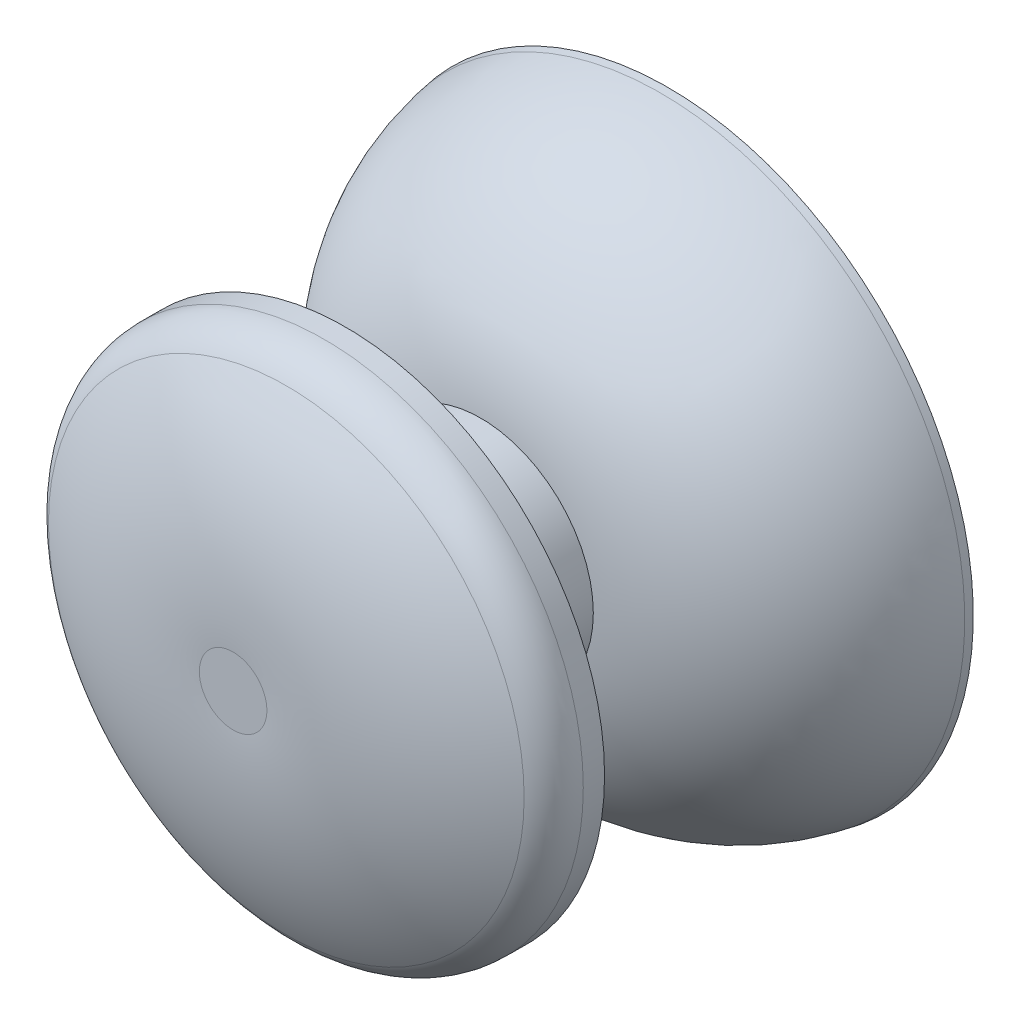
ISO-10303-21;
HEADER;
FILE_DESCRIPTION(('STEP AP214'),'2;1');
FILE_NAME('part.step','',(''),(''),'','','');
FILE_SCHEMA(('AUTOMOTIVE_DESIGN { 1 0 10303 214 1 1 1 1 }'));
ENDSEC;
DATA;
#1=APPLICATION_CONTEXT('core data for automotive mechanical design processes');
#2=APPLICATION_PROTOCOL_DEFINITION('international standard','automotive_design',2000,#1);
#3=PRODUCT_CONTEXT('',#1,'mechanical');
#4=PRODUCT('Part','Part','',(#3));
#5=PRODUCT_RELATED_PRODUCT_CATEGORY('part','',(#4));
#6=PRODUCT_DEFINITION_FORMATION('','',#4);
#7=PRODUCT_DEFINITION_CONTEXT('part definition',#1,'design');
#8=PRODUCT_DEFINITION('design','',#6,#7);
#9=PRODUCT_DEFINITION_SHAPE('','',#8);
#10=(LENGTH_UNIT() NAMED_UNIT(*) SI_UNIT(.MILLI.,.METRE.));
#11=(NAMED_UNIT(*) PLANE_ANGLE_UNIT() SI_UNIT($,.RADIAN.));
#12=(NAMED_UNIT(*) SI_UNIT($,.STERADIAN.) SOLID_ANGLE_UNIT());
#13=UNCERTAINTY_MEASURE_WITH_UNIT(LENGTH_MEASURE(1.E-05),#10,'distance_accuracy_value','');
#14=(GEOMETRIC_REPRESENTATION_CONTEXT(3) GLOBAL_UNCERTAINTY_ASSIGNED_CONTEXT((#13)) GLOBAL_UNIT_ASSIGNED_CONTEXT((#10,
#11,#12)) REPRESENTATION_CONTEXT('',''));
#15=CARTESIAN_POINT('',(0.,0.,0.));
#16=DIRECTION('',(0.,0.,1.));
#17=DIRECTION('',(1.,0.,0.));
#18=AXIS2_PLACEMENT_3D('',#15,#16,#17);
#19=CARTESIAN_POINT('',(55.2886051822846,12.3610868283743,18.2552883496559));
#20=DIRECTION('',(0.,0.,-1.));
#21=DIRECTION('',(-1.,0.,0.));
#22=AXIS2_PLACEMENT_3D('',#19,#20,#21);
#23=DEGENERATE_TOROIDAL_SURFACE('',#22,2.30270713318515,15.5154899332562,.T.);
#24=CARTESIAN_POINT('',(55.2886051822846,12.3610868283743,33.75));
#25=DIRECTION('',(0.,0.,-1.));
#26=DIRECTION('',(-1.,0.,0.));
#27=AXIS2_PLACEMENT_3D('',#24,#25,#26);
#28=CIRCLE('',#27,1.49999999999958);
#29=CARTESIAN_POINT('',(53.788605182285,12.3610868283743,33.75));
#30=VERTEX_POINT('',#29);
#31=EDGE_CURVE('E10',#30,#30,#28,.T.);
#32=ORIENTED_EDGE('',*,*,#31,.T.);
#33=EDGE_LOOP('',(#32));
#34=FACE_BOUND('',#33,.T.);
#35=CARTESIAN_POINT('',(55.2886051822846,12.3610868283743,31.3878518606448));
#36=DIRECTION('',(0.,0.,-1.));
#37=DIRECTION('',(-1.,0.,0.));
#38=AXIS2_PLACEMENT_3D('',#35,#36,#37);
#39=CIRCLE('',#38,10.5650435762754);
#40=CARTESIAN_POINT('',(44.7235616060092,12.3610868283743,31.3878518606448));
#41=VERTEX_POINT('',#40);
#42=EDGE_CURVE('E73',#41,#41,#39,.T.);
#43=ORIENTED_EDGE('',*,*,#42,.F.);
#44=EDGE_LOOP('',(#43));
#45=FACE_BOUND('',#44,.T.);
#46=ADVANCED_FACE('F30',(#34,#45),#23,.T.);
#47=CARTESIAN_POINT('',(56.7886051822842,12.3610868283743,33.75));
#48=DIRECTION('',(0.,0.,1.));
#49=DIRECTION('',(1.,0.,0.));
#50=AXIS2_PLACEMENT_3D('',#47,#48,#49);
#51=PLANE('',#50);
#52=ORIENTED_EDGE('',*,*,#31,.F.);
#53=EDGE_LOOP('',(#52));
#54=FACE_BOUND('',#53,.T.);
#55=ADVANCED_FACE('F81',(#54),#51,.T.);
#56=CARTESIAN_POINT('',(55.2886051822846,12.3610868283743,24.5842158486551));
#57=DIRECTION('',(0.,0.,-1.));
#58=DIRECTION('',(-1.,0.,0.));
#59=AXIS2_PLACEMENT_3D('',#56,#57,#58);
#60=PLANE('',#59);
#61=CARTESIAN_POINT('',(55.2886051822846,12.3610868283743,24.5842158486551));
#62=DIRECTION('',(0.,0.,-1.));
#63=DIRECTION('',(-1.,0.,0.));
#64=AXIS2_PLACEMENT_3D('',#61,#62,#63);
#65=CIRCLE('',#64,1.61377989283939);
#66=CARTESIAN_POINT('',(53.6748252894452,12.3610868283743,24.5842158486551));
#67=VERTEX_POINT('',#66);
#68=EDGE_CURVE('E36',#67,#67,#65,.T.);
#69=ORIENTED_EDGE('',*,*,#68,.T.);
#70=EDGE_LOOP('',(#69));
#71=FACE_BOUND('',#70,.T.);
#72=ADVANCED_FACE('F85',(#71),#60,.T.);
#73=CARTESIAN_POINT('',(55.2886051822846,12.3610868283743,33.7707782829122));
#74=DIRECTION('',(0.,0.,-1.));
#75=DIRECTION('',(-1.,0.,0.));
#76=AXIS2_PLACEMENT_3D('',#73,#74,#75);
#77=CYLINDRICAL_SURFACE('',#76,1.61377989283939);
#78=CARTESIAN_POINT('',(55.2886051822846,12.3610868283743,19.6671079243275));
#79=DIRECTION('',(0.,0.,-1.));
#80=DIRECTION('',(-1.,0.,0.));
#81=AXIS2_PLACEMENT_3D('',#78,#79,#80);
#82=CIRCLE('',#81,1.61377989283939);
#83=CARTESIAN_POINT('',(53.6748252894452,12.3610868283743,19.6671079243275));
#84=VERTEX_POINT('',#83);
#85=EDGE_CURVE('E40',#84,#84,#82,.T.);
#86=ORIENTED_EDGE('',*,*,#85,.T.);
#87=EDGE_LOOP('',(#86));
#88=FACE_BOUND('',#87,.T.);
#89=ORIENTED_EDGE('',*,*,#68,.F.);
#90=EDGE_LOOP('',(#89));
#91=FACE_BOUND('',#90,.T.);
#92=ADVANCED_FACE('F90',(#88,#91),#77,.F.);
#93=CARTESIAN_POINT('',(56.902385075124,12.3610868283743,19.6671079243275));
#94=DIRECTION('',(0.,0.,-1.));
#95=DIRECTION('',(-1.,0.,0.));
#96=AXIS2_PLACEMENT_3D('',#93,#94,#95);
#97=PLANE('',#96);
#98=CARTESIAN_POINT('',(55.2886051822846,12.3610868283743,19.6671079243275));
#99=DIRECTION('',(0.,0.,-1.));
#100=DIRECTION('',(-1.,0.,0.));
#101=AXIS2_PLACEMENT_3D('',#98,#99,#100);
#102=CIRCLE('',#101,8.82212376583157);
#103=CARTESIAN_POINT('',(46.466481416453,12.3610868283743,19.6671079243275));
#104=VERTEX_POINT('',#103);
#105=EDGE_CURVE('E44',#104,#104,#102,.T.);
#106=ORIENTED_EDGE('',*,*,#105,.T.);
#107=EDGE_LOOP('',(#106));
#108=FACE_BOUND('',#107,.T.);
#109=ORIENTED_EDGE('',*,*,#85,.F.);
#110=EDGE_LOOP('',(#109));
#111=FACE_BOUND('',#110,.T.);
#112=ADVANCED_FACE('F95',(#108,#111),#97,.T.);
#113=CARTESIAN_POINT('',(55.2886051822846,12.3610868283743,13.0193991709851));
#114=DIRECTION('',(0.,0.,-1.));
#115=DIRECTION('',(-1.,0.,0.));
#116=AXIS2_PLACEMENT_3D('',#113,#114,#115);
#117=DEGENERATE_TOROIDAL_SURFACE('',#116,3.85649333739738,8.29756091999675,.T.);
#118=CARTESIAN_POINT('',(55.2886051822846,12.3610868283743,14.75));
#119=DIRECTION('',(0.,0.,-1.));
#120=DIRECTION('',(-1.,0.,0.));
#121=AXIS2_PLACEMENT_3D('',#118,#119,#120);
#122=CIRCLE('',#121,11.9715742360496);
#123=CARTESIAN_POINT('',(43.317030946235,12.3610868283743,14.75));
#124=VERTEX_POINT('',#123);
#125=EDGE_CURVE('E49',#124,#124,#122,.T.);
#126=ORIENTED_EDGE('',*,*,#125,.T.);
#127=EDGE_LOOP('',(#126));
#128=FACE_BOUND('',#127,.T.);
#129=ORIENTED_EDGE('',*,*,#105,.F.);
#130=EDGE_LOOP('',(#129));
#131=FACE_BOUND('',#130,.T.);
#132=ADVANCED_FACE('F99',(#128,#131),#117,.F.);
#133=CARTESIAN_POINT('',(55.2886051822846,12.3610868283743,14.75));
#134=DIRECTION('',(0.,0.,-1.));
#135=DIRECTION('',(-1.,0.,0.));
#136=AXIS2_PLACEMENT_3D('',#133,#134,#135);
#137=CONICAL_SURFACE('',#136,11.9715742360496,0.210109931154276);
#138=CARTESIAN_POINT('',(55.2886051822846,12.3610868283743,14.42433044389));
#139=DIRECTION('',(0.,0.,-1.));
#140=DIRECTION('',(-1.,0.,0.));
#141=AXIS2_PLACEMENT_3D('',#138,#139,#140);
#142=CIRCLE('',#141,12.0410256698465);
#143=CARTESIAN_POINT('',(43.2475795124381,12.3610868283743,14.42433044389));
#144=VERTEX_POINT('',#143);
#145=EDGE_CURVE('E52',#144,#144,#142,.T.);
#146=ORIENTED_EDGE('',*,*,#145,.T.);
#147=EDGE_LOOP('',(#146));
#148=FACE_BOUND('',#147,.T.);
#149=ORIENTED_EDGE('',*,*,#125,.F.);
#150=EDGE_LOOP('',(#149));
#151=FACE_BOUND('',#150,.T.);
#152=ADVANCED_FACE('F103',(#148,#151),#137,.F.);
#153=CARTESIAN_POINT('',(67.3296308521311,12.3610868283743,14.42433044389));
#154=DIRECTION('',(0.,0.,-1.));
#155=DIRECTION('',(-1.,0.,0.));
#156=AXIS2_PLACEMENT_3D('',#153,#154,#155);
#157=PLANE('',#156);
#158=CARTESIAN_POINT('',(55.2886051822846,12.3610868283743,14.42433044389));
#159=DIRECTION('',(0.,0.,-1.));
#160=DIRECTION('',(-1.,0.,0.));
#161=AXIS2_PLACEMENT_3D('',#158,#159,#160);
#162=CIRCLE('',#161,13.5537477082164);
#163=CARTESIAN_POINT('',(41.7348574740682,12.3610868283743,14.42433044389));
#164=VERTEX_POINT('',#163);
#165=EDGE_CURVE('E55',#164,#164,#162,.T.);
#166=ORIENTED_EDGE('',*,*,#165,.T.);
#167=EDGE_LOOP('',(#166));
#168=FACE_BOUND('',#167,.T.);
#169=ORIENTED_EDGE('',*,*,#145,.F.);
#170=EDGE_LOOP('',(#169));
#171=FACE_BOUND('',#170,.T.);
#172=ADVANCED_FACE('F107',(#168,#171),#157,.T.);
#173=CARTESIAN_POINT('',(55.2886051822846,12.3610868283743,14.42433044389));
#174=DIRECTION('',(0.,0.,-1.));
#175=DIRECTION('',(-1.,0.,0.));
#176=AXIS2_PLACEMENT_3D('',#173,#174,#175);
#177=CONICAL_SURFACE('',#176,13.5537477082164,0.163563181067571);
#178=CARTESIAN_POINT('',(55.2886051822846,12.3610868283743,14.75));
#179=DIRECTION('',(0.,0.,-1.));
#180=DIRECTION('',(-1.,0.,0.));
#181=AXIS2_PLACEMENT_3D('',#178,#179,#180);
#182=CIRCLE('',#181,13.5);
#183=CARTESIAN_POINT('',(41.7886051822846,12.3610868283743,14.75));
#184=VERTEX_POINT('',#183);
#185=EDGE_CURVE('E58',#184,#184,#182,.T.);
#186=ORIENTED_EDGE('',*,*,#185,.T.);
#187=EDGE_LOOP('',(#186));
#188=FACE_BOUND('',#187,.T.);
#189=ORIENTED_EDGE('',*,*,#165,.F.);
#190=EDGE_LOOP('',(#189));
#191=FACE_BOUND('',#190,.T.);
#192=ADVANCED_FACE('F111',(#188,#191),#177,.T.);
#193=CARTESIAN_POINT('',(55.2886051822846,12.3610868283743,13.0193991709851));
#194=DIRECTION('',(0.,0.,-1.));
#195=DIRECTION('',(-1.,0.,0.));
#196=AXIS2_PLACEMENT_3D('',#193,#194,#195);
#197=DEGENERATE_TOROIDAL_SURFACE('',#196,3.85649333739738,9.79756091999665,.T.);
#198=CARTESIAN_POINT('',(55.2886051822846,12.3610868283743,22.7500000000002));
#199=DIRECTION('',(0.,0.,-1.));
#200=DIRECTION('',(-1.,0.,0.));
#201=AXIS2_PLACEMENT_3D('',#198,#199,#200);
#202=CIRCLE('',#201,5.00000000000002);
#203=CARTESIAN_POINT('',(50.2886051822846,12.3610868283743,22.7500000000002));
#204=VERTEX_POINT('',#203);
#205=EDGE_CURVE('E61',#204,#204,#202,.T.);
#206=ORIENTED_EDGE('',*,*,#205,.T.);
#207=EDGE_LOOP('',(#206));
#208=FACE_BOUND('',#207,.T.);
#209=ORIENTED_EDGE('',*,*,#185,.F.);
#210=EDGE_LOOP('',(#209));
#211=FACE_BOUND('',#210,.T.);
#212=ADVANCED_FACE('F115',(#208,#211),#197,.T.);
#213=CARTESIAN_POINT('',(55.2886051822846,12.3610868283743,33.7707782829122));
#214=DIRECTION('',(0.,0.,-1.));
#215=DIRECTION('',(-1.,0.,0.));
#216=AXIS2_PLACEMENT_3D('',#213,#214,#215);
#217=CYLINDRICAL_SURFACE('',#216,5.00000000000001);
#218=CARTESIAN_POINT('',(55.2886051822846,12.3610868283743,28.75));
#219=DIRECTION('',(0.,0.,-1.));
#220=DIRECTION('',(-1.,0.,0.));
#221=AXIS2_PLACEMENT_3D('',#218,#219,#220);
#222=CIRCLE('',#221,5.);
#223=CARTESIAN_POINT('',(50.2886051822846,12.3610868283743,28.75));
#224=VERTEX_POINT('',#223);
#225=EDGE_CURVE('E64',#224,#224,#222,.T.);
#226=ORIENTED_EDGE('',*,*,#225,.T.);
#227=EDGE_LOOP('',(#226));
#228=FACE_BOUND('',#227,.T.);
#229=ORIENTED_EDGE('',*,*,#205,.F.);
#230=EDGE_LOOP('',(#229));
#231=FACE_BOUND('',#230,.T.);
#232=ADVANCED_FACE('F119',(#228,#231),#217,.T.);
#233=CARTESIAN_POINT('',(60.2886051822846,12.3610868283743,28.75));
#234=DIRECTION('',(0.,0.,-1.));
#235=DIRECTION('',(-1.,0.,0.));
#236=AXIS2_PLACEMENT_3D('',#233,#234,#235);
#237=PLANE('',#236);
#238=CARTESIAN_POINT('',(55.2886051822846,12.3610868283743,28.75));
#239=DIRECTION('',(0.,0.,-1.));
#240=DIRECTION('',(-1.,0.,0.));
#241=AXIS2_PLACEMENT_3D('',#238,#239,#240);
#242=CIRCLE('',#241,11.5);
#243=CARTESIAN_POINT('',(43.7886051822846,12.3610868283743,28.75));
#244=VERTEX_POINT('',#243);
#245=EDGE_CURVE('E67',#244,#244,#242,.T.);
#246=ORIENTED_EDGE('',*,*,#245,.T.);
#247=EDGE_LOOP('',(#246));
#248=FACE_BOUND('',#247,.T.);
#249=ORIENTED_EDGE('',*,*,#225,.F.);
#250=EDGE_LOOP('',(#249));
#251=FACE_BOUND('',#250,.T.);
#252=ADVANCED_FACE('F123',(#248,#251),#237,.T.);
#253=CARTESIAN_POINT('',(55.2886051822846,12.3610868283743,33.7707782829122));
#254=DIRECTION('',(0.,0.,-1.));
#255=DIRECTION('',(-1.,0.,0.));
#256=AXIS2_PLACEMENT_3D('',#253,#254,#255);
#257=CYLINDRICAL_SURFACE('',#256,11.5);
#258=CARTESIAN_POINT('',(55.2886051822846,12.3610868283743,29.6950192697976));
#259=DIRECTION('',(0.,0.,-1.));
#260=DIRECTION('',(-1.,0.,0.));
#261=AXIS2_PLACEMENT_3D('',#258,#259,#260);
#262=CIRCLE('',#261,11.5);
#263=CARTESIAN_POINT('',(43.7886051822846,12.3610868283743,29.6950192697976));
#264=VERTEX_POINT('',#263);
#265=EDGE_CURVE('E70',#264,#264,#262,.T.);
#266=ORIENTED_EDGE('',*,*,#265,.T.);
#267=EDGE_LOOP('',(#266));
#268=FACE_BOUND('',#267,.T.);
#269=ORIENTED_EDGE('',*,*,#245,.F.);
#270=EDGE_LOOP('',(#269));
#271=FACE_BOUND('',#270,.T.);
#272=ADVANCED_FACE('F127',(#268,#271),#257,.T.);
#273=CARTESIAN_POINT('',(55.2886051822846,12.3610868283743,29.6950192697976));
#274=DIRECTION('',(0.,0.,-1.));
#275=DIRECTION('',(-1.,0.,0.));
#276=AXIS2_PLACEMENT_3D('',#273,#274,#275);
#277=TOROIDAL_SURFACE('',#276,9.5,2.00000000000001);
#278=ORIENTED_EDGE('',*,*,#42,.T.);
#279=EDGE_LOOP('',(#278));
#280=FACE_BOUND('',#279,.T.);
#281=ORIENTED_EDGE('',*,*,#265,.F.);
#282=EDGE_LOOP('',(#281));
#283=FACE_BOUND('',#282,.T.);
#284=ADVANCED_FACE('F77',(#280,#283),#277,.T.);
#285=CLOSED_SHELL('',(#46,#55,#72,#92,#112,#132,#152,#172,#192,#212,#232,#252,#272,#284));
#286=MANIFOLD_SOLID_BREP('B2',#285);
#287=ADVANCED_BREP_SHAPE_REPRESENTATION('',(#18,#286),#14);
#288=SHAPE_DEFINITION_REPRESENTATION(#9,#287);
ENDSEC;
END-ISO-10303-21;
